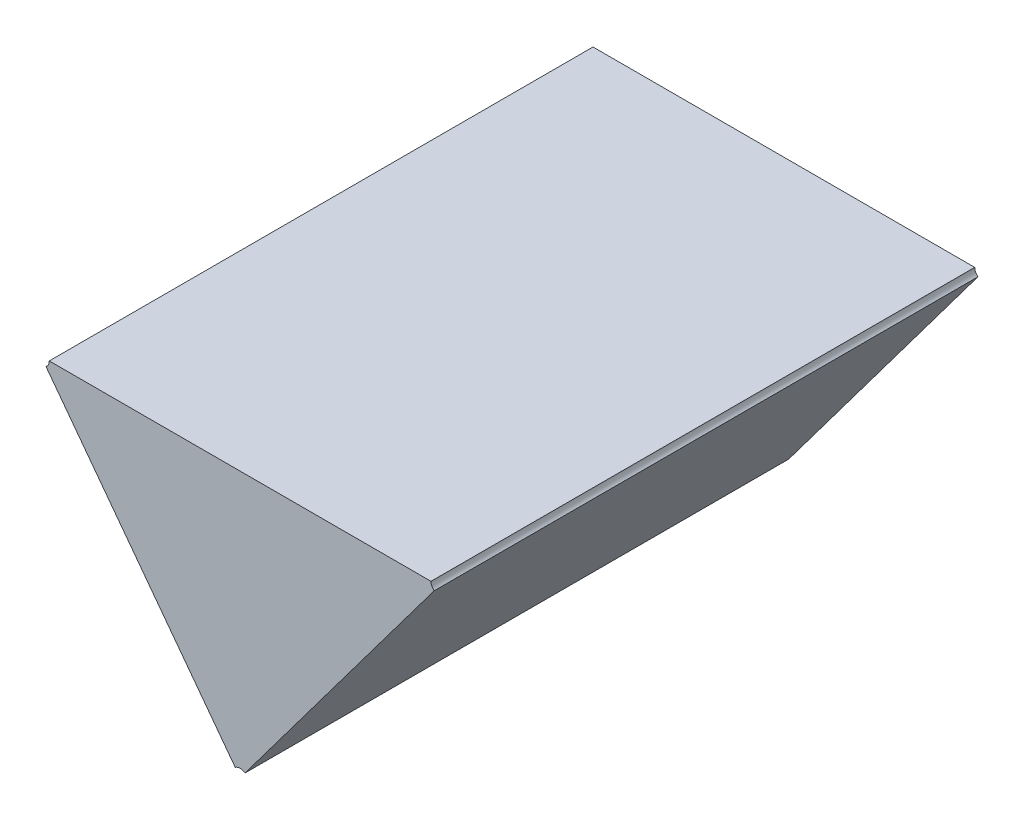
ISO-10303-21;
HEADER;
FILE_DESCRIPTION(('STEP AP214'),'2;1');
FILE_NAME('part.step','',(''),(''),'','','');
FILE_SCHEMA(('AUTOMOTIVE_DESIGN { 1 0 10303 214 1 1 1 1 }'));
ENDSEC;
DATA;
#1=APPLICATION_CONTEXT('core data for automotive mechanical design processes');
#2=APPLICATION_PROTOCOL_DEFINITION('international standard','automotive_design',2000,#1);
#3=PRODUCT_CONTEXT('',#1,'mechanical');
#4=PRODUCT('Part','Part','',(#3));
#5=PRODUCT_RELATED_PRODUCT_CATEGORY('part','',(#4));
#6=PRODUCT_DEFINITION_FORMATION('','',#4);
#7=PRODUCT_DEFINITION_CONTEXT('part definition',#1,'design');
#8=PRODUCT_DEFINITION('design','',#6,#7);
#9=PRODUCT_DEFINITION_SHAPE('','',#8);
#10=(LENGTH_UNIT() NAMED_UNIT(*) SI_UNIT(.MILLI.,.METRE.));
#11=(NAMED_UNIT(*) PLANE_ANGLE_UNIT() SI_UNIT($,.RADIAN.));
#12=(NAMED_UNIT(*) SI_UNIT($,.STERADIAN.) SOLID_ANGLE_UNIT());
#13=UNCERTAINTY_MEASURE_WITH_UNIT(LENGTH_MEASURE(1.E-05),#10,'distance_accuracy_value','');
#14=(GEOMETRIC_REPRESENTATION_CONTEXT(3) GLOBAL_UNCERTAINTY_ASSIGNED_CONTEXT((#13)) GLOBAL_UNIT_ASSIGNED_CONTEXT((#10,
#11,#12)) REPRESENTATION_CONTEXT('',''));
#15=CARTESIAN_POINT('',(0.,0.,0.));
#16=DIRECTION('',(0.,0.,1.));
#17=DIRECTION('',(1.,0.,0.));
#18=AXIS2_PLACEMENT_3D('',#15,#16,#17);
#19=CARTESIAN_POINT('',(-0.823004241303045,-0.756268616332081,0.1));
#20=DIRECTION('',(0.,0.,1.));
#21=DIRECTION('',(1.,0.,0.));
#22=AXIS2_PLACEMENT_3D('',#19,#20,#21);
#23=PLANE('',#22);
#24=CARTESIAN_POINT('',(-0.871804418110991,-0.737952270258831,0.1));
#25=DIRECTION('',(0.,0.,-1.));
#26=DIRECTION('',(1.,0.,0.));
#27=AXIS2_PLACEMENT_3D('',#24,#25,#26);
#28=CIRCLE('',#27,0.0015);
#29=CARTESIAN_POINT('',(-0.870304418110991,-0.737952270258831,0.1));
#30=VERTEX_POINT('',#29);
#31=CARTESIAN_POINT('',(-0.870904827876717,-0.739152577473839,0.1));
#32=VERTEX_POINT('',#31);
#33=EDGE_CURVE('E11',#30,#32,#28,.T.);
#34=ORIENTED_EDGE('',*,*,#33,.T.);
#35=DIRECTION('',(-0.599726822848935,0.80020481000524,0.));
#36=VECTOR('',#35,1.);
#37=CARTESIAN_POINT('',(-0.836102574069129,-0.785588604402836,0.1));
#38=LINE('',#37,#36);
#39=CARTESIAN_POINT('',(-0.836102574069129,-0.785588604402836,0.1));
#40=VERTEX_POINT('',#39);
#41=EDGE_CURVE('E114',#40,#32,#38,.T.);
#42=ORIENTED_EDGE('',*,*,#41,.F.);
#43=CARTESIAN_POINT('',(-0.835202983834856,-0.786788911617844,0.1));
#44=DIRECTION('',(0.,0.,-1.));
#45=DIRECTION('',(-0.599726822848691,0.800204810005423,0.));
#46=AXIS2_PLACEMENT_3D('',#43,#44,#45);
#47=CIRCLE('',#46,0.0015);
#48=CARTESIAN_POINT('',(-0.834303393600583,-0.785588604402836,0.1));
#49=VERTEX_POINT('',#48);
#50=EDGE_CURVE('E90',#40,#49,#47,.T.);
#51=ORIENTED_EDGE('',*,*,#50,.T.);
#52=DIRECTION('',(0.599726822848937,0.800204810005238,0.));
#53=VECTOR('',#52,1.);
#54=CARTESIAN_POINT('',(-0.834303393600583,-0.785588604402836,0.1));
#55=LINE('',#54,#53);
#56=CARTESIAN_POINT('',(-0.799501139792995,-0.739152577473839,0.1));
#57=VERTEX_POINT('',#56);
#58=EDGE_CURVE('E102',#49,#57,#55,.T.);
#59=ORIENTED_EDGE('',*,*,#58,.T.);
#60=CARTESIAN_POINT('',(-0.798601549558721,-0.737952270258831,0.1));
#61=DIRECTION('',(0.,0.,-1.));
#62=DIRECTION('',(-0.599726822849165,-0.800204810005067,0.));
#63=AXIS2_PLACEMENT_3D('',#60,#61,#62);
#64=CIRCLE('',#63,0.0015);
#65=CARTESIAN_POINT('',(-0.800101549558721,-0.737952270258831,0.1));
#66=VERTEX_POINT('',#65);
#67=EDGE_CURVE('E77',#57,#66,#64,.T.);
#68=ORIENTED_EDGE('',*,*,#67,.T.);
#69=DIRECTION('',(-1.,0.,0.));
#70=VECTOR('',#69,1.);
#71=CARTESIAN_POINT('',(-0.800101549558721,-0.737952270258831,0.1));
#72=LINE('',#71,#70);
#73=EDGE_CURVE('E110',#66,#30,#72,.T.);
#74=ORIENTED_EDGE('',*,*,#73,.T.);
#75=EDGE_LOOP('',(#34,#42,#51,#59,#68,#74));
#76=FACE_BOUND('',#75,.T.);
#77=ADVANCED_FACE('F17',(#76),#23,.T.);
#78=CARTESIAN_POINT('',(-0.798601549558721,-0.737952270258831,0.));
#79=DIRECTION('',(0.,1.,0.));
#80=DIRECTION('',(-1.,0.,0.));
#81=AXIS2_PLACEMENT_3D('',#78,#79,#80);
#82=PLANE('',#81);
#83=DIRECTION('',(0.,0.,1.));
#84=VECTOR('',#83,1.);
#85=CARTESIAN_POINT('',(-0.870304418110991,-0.737952270258831,0.));
#86=LINE('',#85,#84);
#87=CARTESIAN_POINT('',(-0.870304418110991,-0.737952270258831,0.));
#88=VERTEX_POINT('',#87);
#89=EDGE_CURVE('E24',#88,#30,#86,.T.);
#90=ORIENTED_EDGE('',*,*,#89,.T.);
#91=ORIENTED_EDGE('',*,*,#73,.F.);
#92=DIRECTION('',(0.,0.,-1.));
#93=VECTOR('',#92,1.);
#94=CARTESIAN_POINT('',(-0.800101549558721,-0.737952270258831,0.1));
#95=LINE('',#94,#93);
#96=CARTESIAN_POINT('',(-0.800101549558721,-0.737952270258831,0.));
#97=VERTEX_POINT('',#96);
#98=EDGE_CURVE('E104',#66,#97,#95,.T.);
#99=ORIENTED_EDGE('',*,*,#98,.T.);
#100=DIRECTION('',(-1.,0.,0.));
#101=VECTOR('',#100,1.);
#102=CARTESIAN_POINT('',(-0.800101549558721,-0.737952270258831,0.));
#103=LINE('',#102,#101);
#104=EDGE_CURVE('E99',#97,#88,#103,.T.);
#105=ORIENTED_EDGE('',*,*,#104,.T.);
#106=EDGE_LOOP('',(#90,#91,#99,#105));
#107=FACE_BOUND('',#106,.T.);
#108=ADVANCED_FACE('F119',(#107),#82,.T.);
#109=CARTESIAN_POINT('',(-0.835202983834856,-0.786788911617844,0.));
#110=DIRECTION('',(0.800204810005239,-0.599726822848936,0.));
#111=DIRECTION('',(0.599726822848936,0.800204810005239,0.));
#112=AXIS2_PLACEMENT_3D('',#109,#110,#111);
#113=PLANE('',#112);
#114=DIRECTION('',(0.,0.,-1.));
#115=VECTOR('',#114,1.);
#116=CARTESIAN_POINT('',(-0.834303393600583,-0.785588604402836,0.1));
#117=LINE('',#116,#115);
#118=CARTESIAN_POINT('',(-0.834303393600583,-0.785588604402836,0.));
#119=VERTEX_POINT('',#118);
#120=EDGE_CURVE('E112',#49,#119,#117,.T.);
#121=ORIENTED_EDGE('',*,*,#120,.T.);
#122=DIRECTION('',(0.599726822848937,0.800204810005238,0.));
#123=VECTOR('',#122,1.);
#124=CARTESIAN_POINT('',(-0.834303393600583,-0.785588604402836,0.));
#125=LINE('',#124,#123);
#126=CARTESIAN_POINT('',(-0.799501139792995,-0.739152577473839,0.));
#127=VERTEX_POINT('',#126);
#128=EDGE_CURVE('E85',#119,#127,#125,.T.);
#129=ORIENTED_EDGE('',*,*,#128,.T.);
#130=DIRECTION('',(0.,0.,1.));
#131=VECTOR('',#130,1.);
#132=CARTESIAN_POINT('',(-0.799501139792995,-0.739152577473839,0.));
#133=LINE('',#132,#131);
#134=EDGE_CURVE('E96',#127,#57,#133,.T.);
#135=ORIENTED_EDGE('',*,*,#134,.T.);
#136=ORIENTED_EDGE('',*,*,#58,.F.);
#137=EDGE_LOOP('',(#121,#129,#135,#136));
#138=FACE_BOUND('',#137,.T.);
#139=ADVANCED_FACE('F127',(#138),#113,.T.);
#140=CARTESIAN_POINT('',(-0.823004241303045,-0.756268616332081,0.));
#141=DIRECTION('',(0.,0.,1.));
#142=DIRECTION('',(1.,0.,0.));
#143=AXIS2_PLACEMENT_3D('',#140,#141,#142);
#144=PLANE('',#143);
#145=CARTESIAN_POINT('',(-0.871804418110991,-0.737952270258831,0.));
#146=DIRECTION('',(0.,0.,1.));
#147=DIRECTION('',(0.599726822849165,-0.800204810005067,0.));
#148=AXIS2_PLACEMENT_3D('',#145,#146,#147);
#149=CIRCLE('',#148,0.0015);
#150=CARTESIAN_POINT('',(-0.870904827876717,-0.739152577473839,0.));
#151=VERTEX_POINT('',#150);
#152=EDGE_CURVE('E107',#151,#88,#149,.T.);
#153=ORIENTED_EDGE('',*,*,#152,.T.);
#154=ORIENTED_EDGE('',*,*,#104,.F.);
#155=CARTESIAN_POINT('',(-0.798601549558721,-0.737952270258831,0.));
#156=DIRECTION('',(0.,0.,1.));
#157=DIRECTION('',(-1.,0.,0.));
#158=AXIS2_PLACEMENT_3D('',#155,#156,#157);
#159=CIRCLE('',#158,0.0015);
#160=EDGE_CURVE('E78',#97,#127,#159,.T.);
#161=ORIENTED_EDGE('',*,*,#160,.T.);
#162=ORIENTED_EDGE('',*,*,#128,.F.);
#163=CARTESIAN_POINT('',(-0.835202983834856,-0.786788911617844,0.));
#164=DIRECTION('',(0.,0.,1.));
#165=DIRECTION('',(0.599726822848691,0.800204810005423,0.));
#166=AXIS2_PLACEMENT_3D('',#163,#164,#165);
#167=CIRCLE('',#166,0.0015);
#168=CARTESIAN_POINT('',(-0.836102574069129,-0.785588604402836,0.));
#169=VERTEX_POINT('',#168);
#170=EDGE_CURVE('E82',#119,#169,#167,.T.);
#171=ORIENTED_EDGE('',*,*,#170,.T.);
#172=DIRECTION('',(-0.599726822848935,0.80020481000524,0.));
#173=VECTOR('',#172,1.);
#174=CARTESIAN_POINT('',(-0.836102574069129,-0.785588604402836,0.));
#175=LINE('',#174,#173);
#176=EDGE_CURVE('E67',#169,#151,#175,.T.);
#177=ORIENTED_EDGE('',*,*,#176,.T.);
#178=EDGE_LOOP('',(#153,#154,#161,#162,#171,#177));
#179=FACE_BOUND('',#178,.T.);
#180=ADVANCED_FACE('F83',(#179),#144,.F.);
#181=CARTESIAN_POINT('',(-0.835202983834856,-0.786788911617844,0.));
#182=DIRECTION('',(0.800204810005239,0.599726822848936,0.));
#183=DIRECTION('',(-0.599726822848936,0.800204810005239,0.));
#184=AXIS2_PLACEMENT_3D('',#181,#182,#183);
#185=PLANE('',#184);
#186=DIRECTION('',(0.,0.,-1.));
#187=VECTOR('',#186,1.);
#188=CARTESIAN_POINT('',(-0.870904827876717,-0.739152577473839,0.1));
#189=LINE('',#188,#187);
#190=EDGE_CURVE('E74',#32,#151,#189,.T.);
#191=ORIENTED_EDGE('',*,*,#190,.T.);
#192=ORIENTED_EDGE('',*,*,#176,.F.);
#193=DIRECTION('',(0.,0.,1.));
#194=VECTOR('',#193,1.);
#195=CARTESIAN_POINT('',(-0.836102574069129,-0.785588604402836,0.));
#196=LINE('',#195,#194);
#197=EDGE_CURVE('E71',#169,#40,#196,.T.);
#198=ORIENTED_EDGE('',*,*,#197,.T.);
#199=ORIENTED_EDGE('',*,*,#41,.T.);
#200=EDGE_LOOP('',(#191,#192,#198,#199));
#201=FACE_BOUND('',#200,.T.);
#202=ADVANCED_FACE('F69',(#201),#185,.F.);
#203=CARTESIAN_POINT('',(-0.798601549558721,-0.737952270258831,0.1));
#204=DIRECTION('',(0.,0.,1.));
#205=DIRECTION('',(-1.,0.,0.));
#206=AXIS2_PLACEMENT_3D('',#203,#204,#205);
#207=CYLINDRICAL_SURFACE('',#206,0.0015);
#208=ORIENTED_EDGE('',*,*,#98,.F.);
#209=ORIENTED_EDGE('',*,*,#67,.F.);
#210=ORIENTED_EDGE('',*,*,#134,.F.);
#211=ORIENTED_EDGE('',*,*,#160,.F.);
#212=EDGE_LOOP('',(#208,#209,#210,#211));
#213=FACE_BOUND('',#212,.T.);
#214=ADVANCED_FACE('F123',(#213),#207,.F.);
#215=CARTESIAN_POINT('',(-0.835202983834856,-0.786788911617844,0.1));
#216=DIRECTION('',(0.,0.,1.));
#217=DIRECTION('',(-1.,0.,0.));
#218=AXIS2_PLACEMENT_3D('',#215,#216,#217);
#219=CYLINDRICAL_SURFACE('',#218,0.0015);
#220=ORIENTED_EDGE('',*,*,#120,.F.);
#221=ORIENTED_EDGE('',*,*,#50,.F.);
#222=ORIENTED_EDGE('',*,*,#197,.F.);
#223=ORIENTED_EDGE('',*,*,#170,.F.);
#224=EDGE_LOOP('',(#220,#221,#222,#223));
#225=FACE_BOUND('',#224,.T.);
#226=ADVANCED_FACE('F89',(#225),#219,.F.);
#227=CARTESIAN_POINT('',(-0.871804418110991,-0.737952270258831,0.1));
#228=DIRECTION('',(0.,0.,1.));
#229=DIRECTION('',(-1.,0.,0.));
#230=AXIS2_PLACEMENT_3D('',#227,#228,#229);
#231=CYLINDRICAL_SURFACE('',#230,0.0015);
#232=ORIENTED_EDGE('',*,*,#89,.F.);
#233=ORIENTED_EDGE('',*,*,#152,.F.);
#234=ORIENTED_EDGE('',*,*,#190,.F.);
#235=ORIENTED_EDGE('',*,*,#33,.F.);
#236=EDGE_LOOP('',(#232,#233,#234,#235));
#237=FACE_BOUND('',#236,.T.);
#238=ADVANCED_FACE('F116',(#237),#231,.F.);
#239=CLOSED_SHELL('',(#77,#108,#139,#180,#202,#214,#226,#238));
#240=MANIFOLD_SOLID_BREP('B1',#239);
#241=ADVANCED_BREP_SHAPE_REPRESENTATION('',(#18,#240),#14);
#242=SHAPE_DEFINITION_REPRESENTATION(#9,#241);
ENDSEC;
END-ISO-10303-21;
